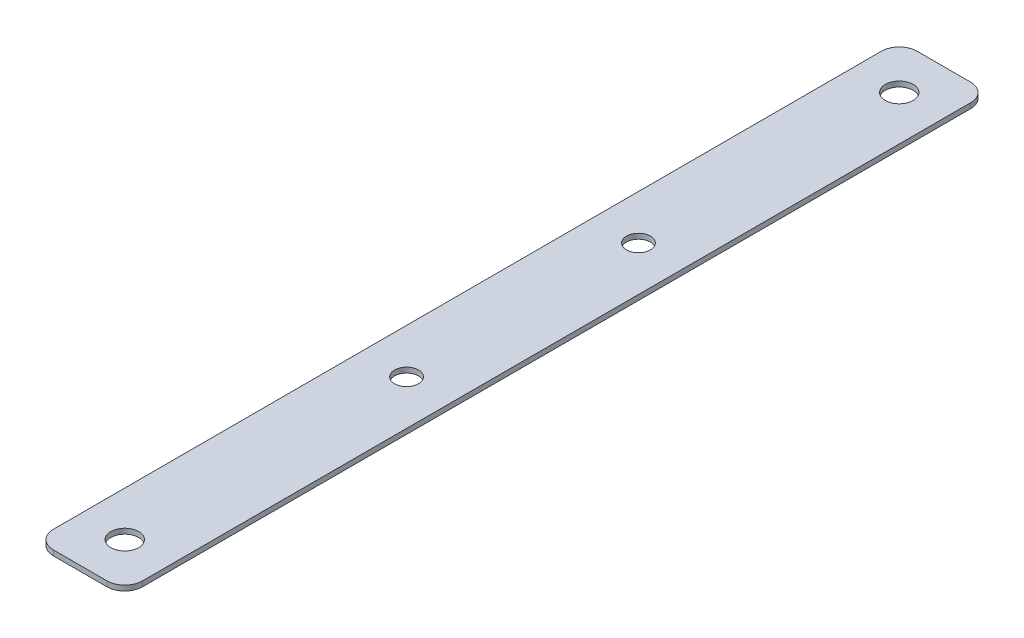
ISO-10303-21;
HEADER;
FILE_DESCRIPTION(('STEP AP214'),'2;1');
FILE_NAME('part.step','',(''),(''),'','','');
FILE_SCHEMA(('AUTOMOTIVE_DESIGN { 1 0 10303 214 1 1 1 1 }'));
ENDSEC;
DATA;
#1=APPLICATION_CONTEXT('core data for automotive mechanical design processes');
#2=APPLICATION_PROTOCOL_DEFINITION('international standard','automotive_design',2000,#1);
#3=PRODUCT_CONTEXT('',#1,'mechanical');
#4=PRODUCT('Part','Part','',(#3));
#5=PRODUCT_RELATED_PRODUCT_CATEGORY('part','',(#4));
#6=PRODUCT_DEFINITION_FORMATION('','',#4);
#7=PRODUCT_DEFINITION_CONTEXT('part definition',#1,'design');
#8=PRODUCT_DEFINITION('design','',#6,#7);
#9=PRODUCT_DEFINITION_SHAPE('','',#8);
#10=(LENGTH_UNIT() NAMED_UNIT(*) SI_UNIT(.MILLI.,.METRE.));
#11=(NAMED_UNIT(*) PLANE_ANGLE_UNIT() SI_UNIT($,.RADIAN.));
#12=(NAMED_UNIT(*) SI_UNIT($,.STERADIAN.) SOLID_ANGLE_UNIT());
#13=UNCERTAINTY_MEASURE_WITH_UNIT(LENGTH_MEASURE(1.E-05),#10,'distance_accuracy_value','');
#14=(GEOMETRIC_REPRESENTATION_CONTEXT(3) GLOBAL_UNCERTAINTY_ASSIGNED_CONTEXT((#13)) GLOBAL_UNIT_ASSIGNED_CONTEXT((#10,
#11,#12)) REPRESENTATION_CONTEXT('',''));
#15=CARTESIAN_POINT('',(0.,0.,0.));
#16=DIRECTION('',(0.,0.,1.));
#17=DIRECTION('',(1.,0.,0.));
#18=AXIS2_PLACEMENT_3D('',#15,#16,#17);
#19=CARTESIAN_POINT('',(0.,-0.7366,0.));
#20=DIRECTION('',(-1.,0.,0.));
#21=DIRECTION('',(0.,0.,1.));
#22=AXIS2_PLACEMENT_3D('',#19,#20,#21);
#23=PLANE('',#22);
#24=DIRECTION('',(0.,0.,1.));
#25=VECTOR('',#24,1.);
#26=CARTESIAN_POINT('',(0.,-0.7366,0.));
#27=LINE('',#26,#25);
#28=CARTESIAN_POINT('',(0.,-0.7366,-120.3706));
#29=VERTEX_POINT('',#28);
#30=CARTESIAN_POINT('',(0.,-0.7366,-2.54));
#31=VERTEX_POINT('',#30);
#32=EDGE_CURVE('E168',#29,#31,#27,.T.);
#33=ORIENTED_EDGE('',*,*,#32,.T.);
#34=DIRECTION('',(0.,1.,0.));
#35=VECTOR('',#34,1.);
#36=CARTESIAN_POINT('',(0.,-0.7366,-2.54));
#37=LINE('',#36,#35);
#38=CARTESIAN_POINT('',(0.,0.,-2.54));
#39=VERTEX_POINT('',#38);
#40=EDGE_CURVE('E115',#31,#39,#37,.T.);
#41=ORIENTED_EDGE('',*,*,#40,.T.);
#42=DIRECTION('',(0.,0.,1.));
#43=VECTOR('',#42,1.);
#44=CARTESIAN_POINT('',(0.,0.,0.));
#45=LINE('',#44,#43);
#46=CARTESIAN_POINT('',(0.,0.,-120.3706));
#47=VERTEX_POINT('',#46);
#48=EDGE_CURVE('E107',#47,#39,#45,.T.);
#49=ORIENTED_EDGE('',*,*,#48,.F.);
#50=DIRECTION('',(0.,1.,0.));
#51=VECTOR('',#50,1.);
#52=CARTESIAN_POINT('',(0.,-0.7366,-120.3706));
#53=LINE('',#52,#51);
#54=EDGE_CURVE('E120',#47,#29,#53,.F.);
#55=ORIENTED_EDGE('',*,*,#54,.T.);
#56=EDGE_LOOP('',(#33,#41,#49,#55));
#57=FACE_BOUND('',#56,.T.);
#58=ADVANCED_FACE('F38',(#57),#23,.T.);
#59=CARTESIAN_POINT('',(0.,-0.7366,-122.9106));
#60=DIRECTION('',(0.,0.,-1.));
#61=DIRECTION('',(-1.,0.,0.));
#62=AXIS2_PLACEMENT_3D('',#59,#60,#61);
#63=PLANE('',#62);
#64=DIRECTION('',(-1.,0.,0.));
#65=VECTOR('',#64,1.);
#66=CARTESIAN_POINT('',(0.,0.,-122.9106));
#67=LINE('',#66,#65);
#68=CARTESIAN_POINT('',(10.16,0.,-122.9106));
#69=VERTEX_POINT('',#68);
#70=CARTESIAN_POINT('',(2.54,0.,-122.9106));
#71=VERTEX_POINT('',#70);
#72=EDGE_CURVE('E109',#69,#71,#67,.T.);
#73=ORIENTED_EDGE('',*,*,#72,.F.);
#74=DIRECTION('',(0.,1.,0.));
#75=VECTOR('',#74,1.);
#76=CARTESIAN_POINT('',(10.16,-0.7366,-122.9106));
#77=LINE('',#76,#75);
#78=CARTESIAN_POINT('',(10.16,-0.7366,-122.9106));
#79=VERTEX_POINT('',#78);
#80=EDGE_CURVE('E11',#69,#79,#77,.F.);
#81=ORIENTED_EDGE('',*,*,#80,.T.);
#82=DIRECTION('',(-1.,0.,0.));
#83=VECTOR('',#82,1.);
#84=CARTESIAN_POINT('',(0.,-0.7366,-122.9106));
#85=LINE('',#84,#83);
#86=CARTESIAN_POINT('',(2.54,-0.7366,-122.9106));
#87=VERTEX_POINT('',#86);
#88=EDGE_CURVE('E128',#79,#87,#85,.T.);
#89=ORIENTED_EDGE('',*,*,#88,.T.);
#90=DIRECTION('',(0.,1.,0.));
#91=VECTOR('',#90,1.);
#92=CARTESIAN_POINT('',(2.54,-0.7366,-122.9106));
#93=LINE('',#92,#91);
#94=EDGE_CURVE('E46',#87,#71,#93,.T.);
#95=ORIENTED_EDGE('',*,*,#94,.T.);
#96=EDGE_LOOP('',(#73,#81,#89,#95));
#97=FACE_BOUND('',#96,.T.);
#98=ADVANCED_FACE('F157',(#97),#63,.T.);
#99=CARTESIAN_POINT('',(12.7,-0.7366,0.));
#100=DIRECTION('',(1.,0.,0.));
#101=DIRECTION('',(0.,0.,-1.));
#102=AXIS2_PLACEMENT_3D('',#99,#100,#101);
#103=PLANE('',#102);
#104=DIRECTION('',(0.,0.,-1.));
#105=VECTOR('',#104,1.);
#106=CARTESIAN_POINT('',(12.7,0.,0.));
#107=LINE('',#106,#105);
#108=CARTESIAN_POINT('',(12.7,0.,-2.54));
#109=VERTEX_POINT('',#108);
#110=CARTESIAN_POINT('',(12.7,0.,-120.3706));
#111=VERTEX_POINT('',#110);
#112=EDGE_CURVE('E166',#109,#111,#107,.T.);
#113=ORIENTED_EDGE('',*,*,#112,.F.);
#114=DIRECTION('',(0.,1.,0.));
#115=VECTOR('',#114,1.);
#116=CARTESIAN_POINT('',(12.7,-0.7366,-2.54));
#117=LINE('',#116,#115);
#118=CARTESIAN_POINT('',(12.7,-0.7366,-2.54));
#119=VERTEX_POINT('',#118);
#120=EDGE_CURVE('E60',#109,#119,#117,.F.);
#121=ORIENTED_EDGE('',*,*,#120,.T.);
#122=DIRECTION('',(0.,0.,-1.));
#123=VECTOR('',#122,1.);
#124=CARTESIAN_POINT('',(12.7,-0.7366,0.));
#125=LINE('',#124,#123);
#126=CARTESIAN_POINT('',(12.7,-0.7366,-120.3706));
#127=VERTEX_POINT('',#126);
#128=EDGE_CURVE('E132',#119,#127,#125,.T.);
#129=ORIENTED_EDGE('',*,*,#128,.T.);
#130=DIRECTION('',(0.,1.,0.));
#131=VECTOR('',#130,1.);
#132=CARTESIAN_POINT('',(12.7,-0.7366,-120.3706));
#133=LINE('',#132,#131);
#134=EDGE_CURVE('E153',#127,#111,#133,.T.);
#135=ORIENTED_EDGE('',*,*,#134,.T.);
#136=EDGE_LOOP('',(#113,#121,#129,#135));
#137=FACE_BOUND('',#136,.T.);
#138=ADVANCED_FACE('F165',(#137),#103,.T.);
#139=CARTESIAN_POINT('',(0.,-0.7366,0.));
#140=DIRECTION('',(0.,0.,1.));
#141=DIRECTION('',(1.,0.,0.));
#142=AXIS2_PLACEMENT_3D('',#139,#140,#141);
#143=PLANE('',#142);
#144=DIRECTION('',(1.,0.,0.));
#145=VECTOR('',#144,1.);
#146=CARTESIAN_POINT('',(0.,0.,0.));
#147=LINE('',#146,#145);
#148=CARTESIAN_POINT('',(2.54,0.,0.));
#149=VERTEX_POINT('',#148);
#150=CARTESIAN_POINT('',(10.16,0.,0.));
#151=VERTEX_POINT('',#150);
#152=EDGE_CURVE('E123',#149,#151,#147,.T.);
#153=ORIENTED_EDGE('',*,*,#152,.F.);
#154=DIRECTION('',(0.,1.,0.));
#155=VECTOR('',#154,1.);
#156=CARTESIAN_POINT('',(2.54,-0.7366,0.));
#157=LINE('',#156,#155);
#158=CARTESIAN_POINT('',(2.54,-0.7366,0.));
#159=VERTEX_POINT('',#158);
#160=EDGE_CURVE('E145',#149,#159,#157,.F.);
#161=ORIENTED_EDGE('',*,*,#160,.T.);
#162=DIRECTION('',(1.,0.,0.));
#163=VECTOR('',#162,1.);
#164=CARTESIAN_POINT('',(0.,-0.7366,0.));
#165=LINE('',#164,#163);
#166=CARTESIAN_POINT('',(10.16,-0.7366,0.));
#167=VERTEX_POINT('',#166);
#168=EDGE_CURVE('E172',#159,#167,#165,.T.);
#169=ORIENTED_EDGE('',*,*,#168,.T.);
#170=DIRECTION('',(0.,1.,0.));
#171=VECTOR('',#170,1.);
#172=CARTESIAN_POINT('',(10.16,-0.7366,0.));
#173=LINE('',#172,#171);
#174=EDGE_CURVE('E142',#167,#151,#173,.T.);
#175=ORIENTED_EDGE('',*,*,#174,.T.);
#176=EDGE_LOOP('',(#153,#161,#169,#175));
#177=FACE_BOUND('',#176,.T.);
#178=ADVANCED_FACE('F232',(#177),#143,.T.);
#179=CARTESIAN_POINT('',(0.,-0.7366,0.));
#180=DIRECTION('',(0.,-1.,0.));
#181=DIRECTION('',(0.,0.,-1.));
#182=AXIS2_PLACEMENT_3D('',#179,#180,#181);
#183=PLANE('',#182);
#184=CARTESIAN_POINT('',(6.35,-0.736600000000004,-116.5606));
#185=DIRECTION('',(0.,1.,0.));
#186=DIRECTION('',(0.,0.,1.));
#187=AXIS2_PLACEMENT_3D('',#184,#185,#186);
#188=CIRCLE('',#187,1.98437499999999);
#189=CARTESIAN_POINT('',(6.35,-0.736600000000004,-114.576225));
#190=VERTEX_POINT('',#189);
#191=EDGE_CURVE('E193',#190,#190,#188,.T.);
#192=ORIENTED_EDGE('',*,*,#191,.T.);
#193=EDGE_LOOP('',(#192));
#194=FACE_BOUND('',#193,.T.);
#195=CARTESIAN_POINT('',(6.35000000000001,-0.736600000000004,-6.35));
#196=DIRECTION('',(0.,1.,0.));
#197=DIRECTION('',(0.,0.,1.));
#198=AXIS2_PLACEMENT_3D('',#195,#196,#197);
#199=CIRCLE('',#198,1.98437499999999);
#200=CARTESIAN_POINT('',(6.35000000000001,-0.736600000000004,-4.36562500000001));
#201=VERTEX_POINT('',#200);
#202=EDGE_CURVE('E187',#201,#201,#199,.T.);
#203=ORIENTED_EDGE('',*,*,#202,.T.);
#204=EDGE_LOOP('',(#203));
#205=FACE_BOUND('',#204,.T.);
#206=CARTESIAN_POINT('',(6.35000000000001,-0.736600000000004,-46.4512));
#207=DIRECTION('',(0.,1.,0.));
#208=DIRECTION('',(0.,0.,1.));
#209=AXIS2_PLACEMENT_3D('',#206,#207,#208);
#210=CIRCLE('',#209,1.69999999999999);
#211=CARTESIAN_POINT('',(6.35000000000001,-0.736600000000004,-44.7512));
#212=VERTEX_POINT('',#211);
#213=EDGE_CURVE('E181',#212,#212,#210,.T.);
#214=ORIENTED_EDGE('',*,*,#213,.T.);
#215=EDGE_LOOP('',(#214));
#216=FACE_BOUND('',#215,.T.);
#217=CARTESIAN_POINT('',(6.35,-0.736600000000004,-79.4512));
#218=DIRECTION('',(0.,1.,0.));
#219=DIRECTION('',(0.,0.,1.));
#220=AXIS2_PLACEMENT_3D('',#217,#218,#219);
#221=CIRCLE('',#220,1.69999999999999);
#222=CARTESIAN_POINT('',(6.35,-0.736600000000004,-77.7512));
#223=VERTEX_POINT('',#222);
#224=EDGE_CURVE('E124',#223,#223,#221,.T.);
#225=ORIENTED_EDGE('',*,*,#224,.T.);
#226=EDGE_LOOP('',(#225));
#227=FACE_BOUND('',#226,.T.);
#228=ORIENTED_EDGE('',*,*,#168,.F.);
#229=CARTESIAN_POINT('',(2.54,-0.7366,-2.54));
#230=DIRECTION('',(0.,-1.,0.));
#231=DIRECTION('',(0.,0.,-1.));
#232=AXIS2_PLACEMENT_3D('',#229,#230,#231);
#233=CIRCLE('',#232,2.54);
#234=EDGE_CURVE('E151',#159,#31,#233,.T.);
#235=ORIENTED_EDGE('',*,*,#234,.T.);
#236=ORIENTED_EDGE('',*,*,#32,.F.);
#237=CARTESIAN_POINT('',(2.54,-0.7366,-120.3706));
#238=DIRECTION('',(0.,-1.,0.));
#239=DIRECTION('',(0.,0.,-1.));
#240=AXIS2_PLACEMENT_3D('',#237,#238,#239);
#241=CIRCLE('',#240,2.54);
#242=EDGE_CURVE('E127',#29,#87,#241,.T.);
#243=ORIENTED_EDGE('',*,*,#242,.T.);
#244=ORIENTED_EDGE('',*,*,#88,.F.);
#245=CARTESIAN_POINT('',(10.16,-0.7366,-120.3706));
#246=DIRECTION('',(0.,-1.,0.));
#247=DIRECTION('',(0.,0.,-1.));
#248=AXIS2_PLACEMENT_3D('',#245,#246,#247);
#249=CIRCLE('',#248,2.54);
#250=EDGE_CURVE('E53',#79,#127,#249,.T.);
#251=ORIENTED_EDGE('',*,*,#250,.T.);
#252=ORIENTED_EDGE('',*,*,#128,.F.);
#253=CARTESIAN_POINT('',(10.16,-0.7366,-2.54));
#254=DIRECTION('',(0.,-1.,0.));
#255=DIRECTION('',(0.,0.,-1.));
#256=AXIS2_PLACEMENT_3D('',#253,#254,#255);
#257=CIRCLE('',#256,2.54);
#258=EDGE_CURVE('E149',#119,#167,#257,.T.);
#259=ORIENTED_EDGE('',*,*,#258,.T.);
#260=EDGE_LOOP('',(#228,#235,#236,#243,#244,#251,#252,#259));
#261=FACE_BOUND('',#260,.T.);
#262=ADVANCED_FACE('F160',(#194,#205,#216,#227,#261),#183,.T.);
#263=CARTESIAN_POINT('',(0.,0.,0.));
#264=DIRECTION('',(0.,-1.,0.));
#265=DIRECTION('',(0.,0.,-1.));
#266=AXIS2_PLACEMENT_3D('',#263,#264,#265);
#267=PLANE('',#266);
#268=CARTESIAN_POINT('',(6.35,0.,-116.5606));
#269=DIRECTION('',(0.,1.,0.));
#270=DIRECTION('',(0.,0.,1.));
#271=AXIS2_PLACEMENT_3D('',#268,#269,#270);
#272=CIRCLE('',#271,1.98437499999999);
#273=CARTESIAN_POINT('',(6.35,0.,-114.576225));
#274=VERTEX_POINT('',#273);
#275=EDGE_CURVE('E196',#274,#274,#272,.T.);
#276=ORIENTED_EDGE('',*,*,#275,.F.);
#277=EDGE_LOOP('',(#276));
#278=FACE_BOUND('',#277,.T.);
#279=CARTESIAN_POINT('',(6.35000000000001,0.,-6.35));
#280=DIRECTION('',(0.,1.,0.));
#281=DIRECTION('',(0.,0.,1.));
#282=AXIS2_PLACEMENT_3D('',#279,#280,#281);
#283=CIRCLE('',#282,1.98437499999999);
#284=CARTESIAN_POINT('',(6.35000000000001,0.,-4.36562500000001));
#285=VERTEX_POINT('',#284);
#286=EDGE_CURVE('E190',#285,#285,#283,.T.);
#287=ORIENTED_EDGE('',*,*,#286,.F.);
#288=EDGE_LOOP('',(#287));
#289=FACE_BOUND('',#288,.T.);
#290=CARTESIAN_POINT('',(6.35000000000001,0.,-46.4512));
#291=DIRECTION('',(0.,1.,0.));
#292=DIRECTION('',(0.,0.,1.));
#293=AXIS2_PLACEMENT_3D('',#290,#291,#292);
#294=CIRCLE('',#293,1.69999999999999);
#295=CARTESIAN_POINT('',(6.35000000000001,0.,-44.7512));
#296=VERTEX_POINT('',#295);
#297=EDGE_CURVE('E184',#296,#296,#294,.T.);
#298=ORIENTED_EDGE('',*,*,#297,.F.);
#299=EDGE_LOOP('',(#298));
#300=FACE_BOUND('',#299,.T.);
#301=CARTESIAN_POINT('',(6.35,0.,-79.4512));
#302=DIRECTION('',(0.,1.,0.));
#303=DIRECTION('',(0.,0.,1.));
#304=AXIS2_PLACEMENT_3D('',#301,#302,#303);
#305=CIRCLE('',#304,1.69999999999999);
#306=CARTESIAN_POINT('',(6.35,0.,-77.7512));
#307=VERTEX_POINT('',#306);
#308=EDGE_CURVE('E178',#307,#307,#305,.T.);
#309=ORIENTED_EDGE('',*,*,#308,.F.);
#310=EDGE_LOOP('',(#309));
#311=FACE_BOUND('',#310,.T.);
#312=ORIENTED_EDGE('',*,*,#48,.T.);
#313=CARTESIAN_POINT('',(2.54,0.,-2.54));
#314=DIRECTION('',(0.,-1.,0.));
#315=DIRECTION('',(0.,0.,-1.));
#316=AXIS2_PLACEMENT_3D('',#313,#314,#315);
#317=CIRCLE('',#316,2.54);
#318=EDGE_CURVE('E140',#39,#149,#317,.F.);
#319=ORIENTED_EDGE('',*,*,#318,.T.);
#320=ORIENTED_EDGE('',*,*,#152,.T.);
#321=CARTESIAN_POINT('',(10.16,0.,-2.54));
#322=DIRECTION('',(0.,-1.,0.));
#323=DIRECTION('',(0.,0.,-1.));
#324=AXIS2_PLACEMENT_3D('',#321,#322,#323);
#325=CIRCLE('',#324,2.54);
#326=EDGE_CURVE('E138',#151,#109,#325,.F.);
#327=ORIENTED_EDGE('',*,*,#326,.T.);
#328=ORIENTED_EDGE('',*,*,#112,.T.);
#329=CARTESIAN_POINT('',(10.16,0.,-120.3706));
#330=DIRECTION('',(0.,-1.,0.));
#331=DIRECTION('',(0.,0.,-1.));
#332=AXIS2_PLACEMENT_3D('',#329,#330,#331);
#333=CIRCLE('',#332,2.54);
#334=EDGE_CURVE('E114',#111,#69,#333,.F.);
#335=ORIENTED_EDGE('',*,*,#334,.T.);
#336=ORIENTED_EDGE('',*,*,#72,.T.);
#337=CARTESIAN_POINT('',(2.54,0.,-120.3706));
#338=DIRECTION('',(0.,-1.,0.));
#339=DIRECTION('',(0.,0.,-1.));
#340=AXIS2_PLACEMENT_3D('',#337,#338,#339);
#341=CIRCLE('',#340,2.54);
#342=EDGE_CURVE('E104',#71,#47,#341,.F.);
#343=ORIENTED_EDGE('',*,*,#342,.T.);
#344=EDGE_LOOP('',(#312,#319,#320,#327,#328,#335,#336,#343));
#345=FACE_BOUND('',#344,.T.);
#346=ADVANCED_FACE('F106',(#278,#289,#300,#311,#345),#267,.F.);
#347=CARTESIAN_POINT('',(6.35,0.,-79.4512));
#348=DIRECTION('',(0.,1.,0.));
#349=DIRECTION('',(0.,0.,1.));
#350=AXIS2_PLACEMENT_3D('',#347,#348,#349);
#351=CYLINDRICAL_SURFACE('',#350,1.69999999999999);
#352=ORIENTED_EDGE('',*,*,#224,.F.);
#353=EDGE_LOOP('',(#352));
#354=FACE_BOUND('',#353,.T.);
#355=ORIENTED_EDGE('',*,*,#308,.T.);
#356=EDGE_LOOP('',(#355));
#357=FACE_BOUND('',#356,.T.);
#358=ADVANCED_FACE('F204',(#354,#357),#351,.F.);
#359=CARTESIAN_POINT('',(6.35000000000001,0.,-46.4512));
#360=DIRECTION('',(0.,1.,0.));
#361=DIRECTION('',(0.,0.,1.));
#362=AXIS2_PLACEMENT_3D('',#359,#360,#361);
#363=CYLINDRICAL_SURFACE('',#362,1.69999999999999);
#364=ORIENTED_EDGE('',*,*,#213,.F.);
#365=EDGE_LOOP('',(#364));
#366=FACE_BOUND('',#365,.T.);
#367=ORIENTED_EDGE('',*,*,#297,.T.);
#368=EDGE_LOOP('',(#367));
#369=FACE_BOUND('',#368,.T.);
#370=ADVANCED_FACE('F213',(#366,#369),#363,.F.);
#371=CARTESIAN_POINT('',(6.35000000000001,0.,-6.35));
#372=DIRECTION('',(0.,1.,0.));
#373=DIRECTION('',(0.,0.,1.));
#374=AXIS2_PLACEMENT_3D('',#371,#372,#373);
#375=CYLINDRICAL_SURFACE('',#374,1.98437499999999);
#376=ORIENTED_EDGE('',*,*,#202,.F.);
#377=EDGE_LOOP('',(#376));
#378=FACE_BOUND('',#377,.T.);
#379=ORIENTED_EDGE('',*,*,#286,.T.);
#380=EDGE_LOOP('',(#379));
#381=FACE_BOUND('',#380,.T.);
#382=ADVANCED_FACE('F219',(#378,#381),#375,.F.);
#383=CARTESIAN_POINT('',(6.35,0.,-116.5606));
#384=DIRECTION('',(0.,1.,0.));
#385=DIRECTION('',(0.,0.,1.));
#386=AXIS2_PLACEMENT_3D('',#383,#384,#385);
#387=CYLINDRICAL_SURFACE('',#386,1.98437499999999);
#388=ORIENTED_EDGE('',*,*,#191,.F.);
#389=EDGE_LOOP('',(#388));
#390=FACE_BOUND('',#389,.T.);
#391=ORIENTED_EDGE('',*,*,#275,.T.);
#392=EDGE_LOOP('',(#391));
#393=FACE_BOUND('',#392,.T.);
#394=ADVANCED_FACE('F200',(#390,#393),#387,.F.);
#395=CARTESIAN_POINT('',(2.54,-0.7366,-2.54));
#396=DIRECTION('',(0.,1.,0.));
#397=DIRECTION('',(0.,0.,1.));
#398=AXIS2_PLACEMENT_3D('',#395,#396,#397);
#399=CYLINDRICAL_SURFACE('',#398,2.54);
#400=ORIENTED_EDGE('',*,*,#234,.F.);
#401=ORIENTED_EDGE('',*,*,#160,.F.);
#402=ORIENTED_EDGE('',*,*,#318,.F.);
#403=ORIENTED_EDGE('',*,*,#40,.F.);
#404=EDGE_LOOP('',(#400,#401,#402,#403));
#405=FACE_BOUND('',#404,.T.);
#406=ADVANCED_FACE('F234',(#405),#399,.T.);
#407=CARTESIAN_POINT('',(10.16,-0.7366,-2.54));
#408=DIRECTION('',(0.,1.,0.));
#409=DIRECTION('',(0.,0.,1.));
#410=AXIS2_PLACEMENT_3D('',#407,#408,#409);
#411=CYLINDRICAL_SURFACE('',#410,2.54);
#412=ORIENTED_EDGE('',*,*,#258,.F.);
#413=ORIENTED_EDGE('',*,*,#120,.F.);
#414=ORIENTED_EDGE('',*,*,#326,.F.);
#415=ORIENTED_EDGE('',*,*,#174,.F.);
#416=EDGE_LOOP('',(#412,#413,#414,#415));
#417=FACE_BOUND('',#416,.T.);
#418=ADVANCED_FACE('F237',(#417),#411,.T.);
#419=CARTESIAN_POINT('',(10.16,-0.7366,-120.3706));
#420=DIRECTION('',(0.,1.,0.));
#421=DIRECTION('',(0.,0.,1.));
#422=AXIS2_PLACEMENT_3D('',#419,#420,#421);
#423=CYLINDRICAL_SURFACE('',#422,2.54);
#424=ORIENTED_EDGE('',*,*,#250,.F.);
#425=ORIENTED_EDGE('',*,*,#80,.F.);
#426=ORIENTED_EDGE('',*,*,#334,.F.);
#427=ORIENTED_EDGE('',*,*,#134,.F.);
#428=EDGE_LOOP('',(#424,#425,#426,#427));
#429=FACE_BOUND('',#428,.T.);
#430=ADVANCED_FACE('F163',(#429),#423,.T.);
#431=CARTESIAN_POINT('',(2.54,-0.7366,-120.3706));
#432=DIRECTION('',(0.,1.,0.));
#433=DIRECTION('',(0.,0.,1.));
#434=AXIS2_PLACEMENT_3D('',#431,#432,#433);
#435=CYLINDRICAL_SURFACE('',#434,2.54);
#436=ORIENTED_EDGE('',*,*,#242,.F.);
#437=ORIENTED_EDGE('',*,*,#54,.F.);
#438=ORIENTED_EDGE('',*,*,#342,.F.);
#439=ORIENTED_EDGE('',*,*,#94,.F.);
#440=EDGE_LOOP('',(#436,#437,#438,#439));
#441=FACE_BOUND('',#440,.T.);
#442=ADVANCED_FACE('F40',(#441),#435,.T.);
#443=CLOSED_SHELL('',(#58,#98,#138,#178,#262,#346,#358,#370,#382,#394,#406,#418,#430,#442));
#444=MANIFOLD_SOLID_BREP('B2',#443);
#445=ADVANCED_BREP_SHAPE_REPRESENTATION('',(#18,#444),#14);
#446=SHAPE_DEFINITION_REPRESENTATION(#9,#445);
ENDSEC;
END-ISO-10303-21;
